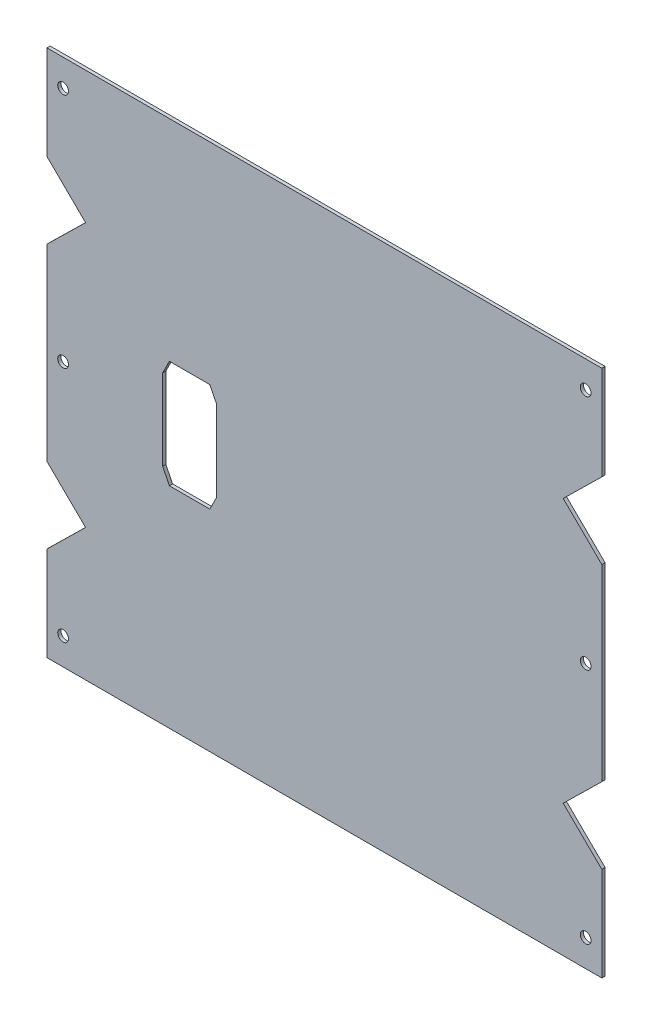
ISO-10303-21;
HEADER;
FILE_DESCRIPTION(('STEP AP214'),'2;1');
FILE_NAME('part.step','',(''),(''),'','','');
FILE_SCHEMA(('AUTOMOTIVE_DESIGN { 1 0 10303 214 1 1 1 1 }'));
ENDSEC;
DATA;
#1=APPLICATION_CONTEXT('core data for automotive mechanical design processes');
#2=APPLICATION_PROTOCOL_DEFINITION('international standard','automotive_design',2000,#1);
#3=PRODUCT_CONTEXT('',#1,'mechanical');
#4=PRODUCT('Part','Part','',(#3));
#5=PRODUCT_RELATED_PRODUCT_CATEGORY('part','',(#4));
#6=PRODUCT_DEFINITION_FORMATION('','',#4);
#7=PRODUCT_DEFINITION_CONTEXT('part definition',#1,'design');
#8=PRODUCT_DEFINITION('design','',#6,#7);
#9=PRODUCT_DEFINITION_SHAPE('','',#8);
#10=(LENGTH_UNIT() NAMED_UNIT(*) SI_UNIT(.MILLI.,.METRE.));
#11=(NAMED_UNIT(*) PLANE_ANGLE_UNIT() SI_UNIT($,.RADIAN.));
#12=(NAMED_UNIT(*) SI_UNIT($,.STERADIAN.) SOLID_ANGLE_UNIT());
#13=UNCERTAINTY_MEASURE_WITH_UNIT(LENGTH_MEASURE(1.E-05),#10,'distance_accuracy_value','');
#14=(GEOMETRIC_REPRESENTATION_CONTEXT(3) GLOBAL_UNCERTAINTY_ASSIGNED_CONTEXT((#13)) GLOBAL_UNIT_ASSIGNED_CONTEXT((#10,
#11,#12)) REPRESENTATION_CONTEXT('',''));
#15=CARTESIAN_POINT('',(0.,0.,0.));
#16=DIRECTION('',(0.,0.,1.));
#17=DIRECTION('',(1.,0.,0.));
#18=AXIS2_PLACEMENT_3D('',#15,#16,#17);
#19=CARTESIAN_POINT('',(0.,0.,-1.2));
#20=DIRECTION('',(0.,0.,1.));
#21=DIRECTION('',(1.,0.,0.));
#22=AXIS2_PLACEMENT_3D('',#19,#20,#21);
#23=PLANE('',#22);
#24=DIRECTION('',(0.71325044915418,0.700909264299852,0.));
#25=VECTOR('',#24,1.);
#26=CARTESIAN_POINT('',(-112.735272182629,25.2473417299541,-1.19999999999987));
#27=LINE('',#26,#25);
#28=CARTESIAN_POINT('',(-102.924778563656,34.8880869591322,-1.19999999999992));
#29=VERTEX_POINT('',#28);
#30=CARTESIAN_POINT('',(-88.5983859319865,48.9665937885951,-1.20000000000002));
#31=VERTEX_POINT('',#30);
#32=EDGE_CURVE('E723',#29,#31,#27,.T.);
#33=ORIENTED_EDGE('',*,*,#32,.T.);
#34=DIRECTION('',(-0.71325044915418,0.700909264299853,0.));
#35=VECTOR('',#34,1.);
#36=CARTESIAN_POINT('',(-112.735272182629,72.6858458472359,-1.1999999999997));
#37=LINE('',#36,#35);
#38=CARTESIAN_POINT('',(-102.924778563656,63.045100618058,-1.19999999999985));
#39=VERTEX_POINT('',#38);
#40=EDGE_CURVE('E753',#31,#39,#37,.T.);
#41=ORIENTED_EDGE('',*,*,#40,.T.);
#42=DIRECTION('',(0.,1.,0.));
#43=VECTOR('',#42,1.);
#44=CARTESIAN_POINT('',(-102.924778563656,50.1160676339586,-1.19999999999993));
#45=LINE('',#44,#43);
#46=CARTESIAN_POINT('',(-102.924778563656,97.9541336551041,-1.19999999999962));
#47=VERTEX_POINT('',#46);
#48=EDGE_CURVE('E759',#47,#39,#45,.F.);
#49=ORIENTED_EDGE('',*,*,#48,.F.);
#50=DIRECTION('',(1.,0.,0.));
#51=VECTOR('',#50,1.);
#52=CARTESIAN_POINT('',(-102.924778563656,97.9541336551041,-1.19999999999962));
#53=LINE('',#52,#51);
#54=CARTESIAN_POINT('',(102.924778563656,97.9541336551041,-1.19999999999956));
#55=VERTEX_POINT('',#54);
#56=EDGE_CURVE('E778',#55,#47,#53,.F.);
#57=ORIENTED_EDGE('',*,*,#56,.F.);
#58=DIRECTION('',(0.,-1.,0.));
#59=VECTOR('',#58,1.);
#60=CARTESIAN_POINT('',(102.924778563656,97.9541336551041,-1.19999999999956));
#61=LINE('',#60,#59);
#62=CARTESIAN_POINT('',(102.924778563656,63.045100618058,-1.19999999999978));
#63=VERTEX_POINT('',#62);
#64=EDGE_CURVE('E772',#63,#55,#61,.F.);
#65=ORIENTED_EDGE('',*,*,#64,.F.);
#66=DIRECTION('',(-0.71325044915418,-0.700909264299853,0.));
#67=VECTOR('',#66,1.);
#68=CARTESIAN_POINT('',(112.735272182628,72.6858458472358,-1.19999999999965));
#69=LINE('',#68,#67);
#70=CARTESIAN_POINT('',(88.5983859319865,48.966593788595,-1.19999999999998));
#71=VERTEX_POINT('',#70);
#72=EDGE_CURVE('E751',#63,#71,#69,.T.);
#73=ORIENTED_EDGE('',*,*,#72,.T.);
#74=DIRECTION('',(0.713250449154181,-0.700909264299852,0.));
#75=VECTOR('',#74,1.);
#76=CARTESIAN_POINT('',(112.735272182629,25.2473417299542,-1.19999999999987));
#77=LINE('',#76,#75);
#78=CARTESIAN_POINT('',(102.924778563656,34.8880869591322,-1.19999999999994));
#79=VERTEX_POINT('',#78);
#80=EDGE_CURVE('E864',#71,#79,#77,.T.);
#81=ORIENTED_EDGE('',*,*,#80,.T.);
#82=DIRECTION('',(0.,-1.,0.));
#83=VECTOR('',#82,1.);
#84=CARTESIAN_POINT('',(102.924778563656,47.8171199432316,-1.19999999999994));
#85=LINE('',#84,#83);
#86=CARTESIAN_POINT('',(102.924778563656,-34.8880869591322,-1.19999999999991));
#87=VERTEX_POINT('',#86);
#88=EDGE_CURVE('E831',#87,#79,#85,.F.);
#89=ORIENTED_EDGE('',*,*,#88,.F.);
#90=DIRECTION('',(-0.71325044915418,-0.700909264299852,0.));
#91=VECTOR('',#90,1.);
#92=CARTESIAN_POINT('',(112.735272182629,-25.2473417299541,-1.19999999999985));
#93=LINE('',#92,#91);
#94=CARTESIAN_POINT('',(88.5983859319865,-48.9665937885951,-1.2));
#95=VERTEX_POINT('',#94);
#96=EDGE_CURVE('E862',#87,#95,#93,.T.);
#97=ORIENTED_EDGE('',*,*,#96,.T.);
#98=DIRECTION('',(0.71325044915418,-0.700909264299853,0.));
#99=VECTOR('',#98,1.);
#100=CARTESIAN_POINT('',(112.735272182629,-72.6858458472359,-1.19999999999974));
#101=LINE('',#100,#99);
#102=CARTESIAN_POINT('',(102.924778563656,-63.045100618058,-1.19999999999987));
#103=VERTEX_POINT('',#102);
#104=EDGE_CURVE('E793',#95,#103,#101,.T.);
#105=ORIENTED_EDGE('',*,*,#104,.T.);
#106=DIRECTION('',(0.,-1.,0.));
#107=VECTOR('',#106,1.);
#108=CARTESIAN_POINT('',(102.924778563656,-50.1160676339586,-1.19999999999993));
#109=LINE('',#108,#107);
#110=CARTESIAN_POINT('',(102.924778563656,-97.9541336551041,-1.19999999999965));
#111=VERTEX_POINT('',#110);
#112=EDGE_CURVE('E804',#111,#103,#109,.F.);
#113=ORIENTED_EDGE('',*,*,#112,.F.);
#114=DIRECTION('',(-1.,0.,0.));
#115=VECTOR('',#114,1.);
#116=CARTESIAN_POINT('',(-89.1247785636565,-97.9541336551041,-1.19999999999969));
#117=LINE('',#116,#115);
#118=CARTESIAN_POINT('',(-102.924778563657,-97.954133655104,-1.19999999999958));
#119=VERTEX_POINT('',#118);
#120=EDGE_CURVE('E819',#119,#111,#117,.F.);
#121=ORIENTED_EDGE('',*,*,#120,.F.);
#122=DIRECTION('',(0.,1.,0.));
#123=VECTOR('',#122,1.);
#124=CARTESIAN_POINT('',(-102.924778563657,-97.954133655104,-1.19999999999958));
#125=LINE('',#124,#123);
#126=CARTESIAN_POINT('',(-102.924778563656,-63.0451006180579,-1.19999999999992));
#127=VERTEX_POINT('',#126);
#128=EDGE_CURVE('E814',#127,#119,#125,.F.);
#129=ORIENTED_EDGE('',*,*,#128,.F.);
#130=DIRECTION('',(0.713250449154182,0.700909264299851,0.));
#131=VECTOR('',#130,1.);
#132=CARTESIAN_POINT('',(-112.735272182629,-72.6858458472357,-1.19999999999976));
#133=LINE('',#132,#131);
#134=CARTESIAN_POINT('',(-88.5983859319865,-48.9665937885951,-1.20000000000018));
#135=VERTEX_POINT('',#134);
#136=EDGE_CURVE('E796',#127,#135,#133,.T.);
#137=ORIENTED_EDGE('',*,*,#136,.T.);
#138=DIRECTION('',(-0.71325044915418,0.700909264299852,0.));
#139=VECTOR('',#138,1.);
#140=CARTESIAN_POINT('',(-112.735272182629,-25.2473417299542,-1.19999999999987));
#141=LINE('',#140,#139);
#142=CARTESIAN_POINT('',(-102.924778563656,-34.8880869591322,-1.19999999999992));
#143=VERTEX_POINT('',#142);
#144=EDGE_CURVE('E728',#135,#143,#141,.T.);
#145=ORIENTED_EDGE('',*,*,#144,.T.);
#146=DIRECTION('',(0.,1.,0.));
#147=VECTOR('',#146,1.);
#148=CARTESIAN_POINT('',(-102.924778563656,-47.8171199432316,-1.19999999999992));
#149=LINE('',#148,#147);
#150=EDGE_CURVE('E790',#29,#143,#149,.F.);
#151=ORIENTED_EDGE('',*,*,#150,.F.);
#152=EDGE_LOOP('',(#33,#41,#49,#57,#65,#73,#81,#89,#97,#105,#113,#121,#129,#137,#145,#151));
#153=FACE_BOUND('',#152,.T.);
#154=DIRECTION('',(-0.447213595499958,-0.894427190999916,0.));
#155=VECTOR('',#154,1.);
#156=CARTESIAN_POINT('',(-60.,14.9832151274244,-1.2));
#157=LINE('',#156,#155);
#158=CARTESIAN_POINT('',(-57.5,19.9832151274244,-1.2));
#159=VERTEX_POINT('',#158);
#160=CARTESIAN_POINT('',(-60.,14.9832151274244,-1.2));
#161=VERTEX_POINT('',#160);
#162=EDGE_CURVE('E892',#159,#161,#157,.T.);
#163=ORIENTED_EDGE('',*,*,#162,.T.);
#164=DIRECTION('',(0.,-1.,0.));
#165=VECTOR('',#164,1.);
#166=CARTESIAN_POINT('',(-60.,-15.0167848725756,-1.2));
#167=LINE('',#166,#165);
#168=CARTESIAN_POINT('',(-60.,-15.0167848725756,-1.2));
#169=VERTEX_POINT('',#168);
#170=EDGE_CURVE('E872',#161,#169,#167,.T.);
#171=ORIENTED_EDGE('',*,*,#170,.T.);
#172=DIRECTION('',(0.447213595499958,-0.894427190999916,0.));
#173=VECTOR('',#172,1.);
#174=CARTESIAN_POINT('',(-57.5,-20.0167848725756,-1.2));
#175=LINE('',#174,#173);
#176=CARTESIAN_POINT('',(-57.5,-20.0167848725756,-1.2));
#177=VERTEX_POINT('',#176);
#178=EDGE_CURVE('E875',#169,#177,#175,.T.);
#179=ORIENTED_EDGE('',*,*,#178,.T.);
#180=DIRECTION('',(1.,0.,0.));
#181=VECTOR('',#180,1.);
#182=CARTESIAN_POINT('',(-42.5,-20.0167848725756,-1.2));
#183=LINE('',#182,#181);
#184=CARTESIAN_POINT('',(-42.5,-20.0167848725756,-1.2));
#185=VERTEX_POINT('',#184);
#186=EDGE_CURVE('E558',#177,#185,#183,.T.);
#187=ORIENTED_EDGE('',*,*,#186,.T.);
#188=DIRECTION('',(0.447213595499958,0.894427190999916,0.));
#189=VECTOR('',#188,1.);
#190=CARTESIAN_POINT('',(-40.,-15.0167848725756,-1.2));
#191=LINE('',#190,#189);
#192=CARTESIAN_POINT('',(-40.,-15.0167848725756,-1.2));
#193=VERTEX_POINT('',#192);
#194=EDGE_CURVE('E880',#185,#193,#191,.T.);
#195=ORIENTED_EDGE('',*,*,#194,.T.);
#196=DIRECTION('',(0.,1.,0.));
#197=VECTOR('',#196,1.);
#198=CARTESIAN_POINT('',(-40.,14.9832151274244,-1.2));
#199=LINE('',#198,#197);
#200=CARTESIAN_POINT('',(-40.,14.9832151274244,-1.2));
#201=VERTEX_POINT('',#200);
#202=EDGE_CURVE('E883',#193,#201,#199,.T.);
#203=ORIENTED_EDGE('',*,*,#202,.T.);
#204=DIRECTION('',(-0.447213595499958,0.894427190999916,0.));
#205=VECTOR('',#204,1.);
#206=CARTESIAN_POINT('',(-42.5,19.9832151274244,-1.2));
#207=LINE('',#206,#205);
#208=CARTESIAN_POINT('',(-42.5,19.9832151274244,-1.2));
#209=VERTEX_POINT('',#208);
#210=EDGE_CURVE('E886',#201,#209,#207,.T.);
#211=ORIENTED_EDGE('',*,*,#210,.T.);
#212=DIRECTION('',(-1.,0.,0.));
#213=VECTOR('',#212,1.);
#214=CARTESIAN_POINT('',(-57.5,19.9832151274244,-1.2));
#215=LINE('',#214,#213);
#216=EDGE_CURVE('E889',#209,#159,#215,.T.);
#217=ORIENTED_EDGE('',*,*,#216,.T.);
#218=EDGE_LOOP('',(#163,#171,#179,#187,#195,#203,#211,#217));
#219=FACE_BOUND('',#218,.T.);
#220=CARTESIAN_POINT('',(96.9247785636565,0.128533104245435,-1.19999999999997));
#221=DIRECTION('',(0.,0.,-1.));
#222=DIRECTION('',(-1.,0.,0.));
#223=AXIS2_PLACEMENT_3D('',#220,#221,#222);
#224=CIRCLE('',#223,2.);
#225=CARTESIAN_POINT('',(94.9247785636565,0.128533104245435,-1.19999999999998));
#226=VERTEX_POINT('',#225);
#227=EDGE_CURVE('E867',#226,#226,#224,.T.);
#228=ORIENTED_EDGE('',*,*,#227,.F.);
#229=EDGE_LOOP('',(#228));
#230=FACE_BOUND('',#229,.T.);
#231=CARTESIAN_POINT('',(-96.9247785636564,0.128533104244721,-1.19999999999997));
#232=DIRECTION('',(0.,0.,-1.));
#233=DIRECTION('',(-1.,0.,0.));
#234=AXIS2_PLACEMENT_3D('',#231,#232,#233);
#235=CIRCLE('',#234,2.);
#236=CARTESIAN_POINT('',(-98.9247785636564,0.128533104244721,-1.19999999999995));
#237=VERTEX_POINT('',#236);
#238=EDGE_CURVE('E842',#237,#237,#235,.T.);
#239=ORIENTED_EDGE('',*,*,#238,.F.);
#240=EDGE_LOOP('',(#239));
#241=FACE_BOUND('',#240,.T.);
#242=CARTESIAN_POINT('',(96.9247785636571,-87.9541336551041,-1.19999999999976));
#243=DIRECTION('',(0.,0.,-1.));
#244=DIRECTION('',(-0.999847695156391,-0.0174524064372864,0.));
#245=AXIS2_PLACEMENT_3D('',#242,#243,#244);
#246=CIRCLE('',#245,2.);
#247=CARTESIAN_POINT('',(94.9250831733443,-87.9890384679787,-1.19999999999977));
#248=VERTEX_POINT('',#247);
#249=EDGE_CURVE('E816',#248,#248,#246,.T.);
#250=ORIENTED_EDGE('',*,*,#249,.F.);
#251=EDGE_LOOP('',(#250));
#252=FACE_BOUND('',#251,.T.);
#253=CARTESIAN_POINT('',(-96.9247785636565,-87.954133655104,-1.19999999999969));
#254=DIRECTION('',(0.,0.,-1.));
#255=DIRECTION('',(-0.999847695156391,0.0174524064372899,0.));
#256=AXIS2_PLACEMENT_3D('',#253,#254,#255);
#257=CIRCLE('',#256,2.);
#258=CARTESIAN_POINT('',(-98.9244739539693,-87.9192288422295,-1.19999999999968));
#259=VERTEX_POINT('',#258);
#260=EDGE_CURVE('E743',#259,#259,#257,.T.);
#261=ORIENTED_EDGE('',*,*,#260,.F.);
#262=EDGE_LOOP('',(#261));
#263=FACE_BOUND('',#262,.T.);
#264=CARTESIAN_POINT('',(96.9247785636557,87.9541336551042,-1.19999999999967));
#265=DIRECTION('',(0.,0.,-1.));
#266=DIRECTION('',(0.999847695156391,-0.0174524064372864,0.));
#267=AXIS2_PLACEMENT_3D('',#264,#265,#266);
#268=CIRCLE('',#267,2.);
#269=CARTESIAN_POINT('',(98.9244739539685,87.9192288422296,-1.19999999999966));
#270=VERTEX_POINT('',#269);
#271=EDGE_CURVE('E780',#270,#270,#268,.T.);
#272=ORIENTED_EDGE('',*,*,#271,.F.);
#273=EDGE_LOOP('',(#272));
#274=FACE_BOUND('',#273,.T.);
#275=CARTESIAN_POINT('',(-96.9247785636564,87.9541336551041,-1.19999999999974));
#276=DIRECTION('',(0.,0.,-1.));
#277=DIRECTION('',(0.999847695156391,0.0174524064372864,0.));
#278=AXIS2_PLACEMENT_3D('',#275,#276,#277);
#279=CIRCLE('',#278,2.);
#280=CARTESIAN_POINT('',(-94.9250831733436,87.9890384679787,-1.19999999999976));
#281=VERTEX_POINT('',#280);
#282=EDGE_CURVE('E740',#281,#281,#279,.T.);
#283=ORIENTED_EDGE('',*,*,#282,.F.);
#284=EDGE_LOOP('',(#283));
#285=FACE_BOUND('',#284,.T.);
#286=ADVANCED_FACE('F541',(#153,#219,#230,#241,#252,#263,#274,#285),#23,.F.);
#287=CARTESIAN_POINT('',(0.,0.,0.));
#288=DIRECTION('',(0.,0.,1.));
#289=DIRECTION('',(1.,0.,0.));
#290=AXIS2_PLACEMENT_3D('',#287,#288,#289);
#291=PLANE('',#290);
#292=DIRECTION('',(-0.71325044915418,0.700909264299853,0.));
#293=VECTOR('',#292,1.);
#294=CARTESIAN_POINT('',(-90.1247785636564,50.4665756501771,0.));
#295=LINE('',#294,#293);
#296=CARTESIAN_POINT('',(-88.5983859319865,48.9665937885951,0.));
#297=VERTEX_POINT('',#296);
#298=CARTESIAN_POINT('',(-102.924778563656,63.045100618058,1.59594559789866E-13));
#299=VERTEX_POINT('',#298);
#300=EDGE_CURVE('E744',#297,#299,#295,.T.);
#301=ORIENTED_EDGE('',*,*,#300,.F.);
#302=DIRECTION('',(0.71325044915418,0.700909264299852,0.));
#303=VECTOR('',#302,1.);
#304=CARTESIAN_POINT('',(-158.454011488257,-19.6803382587869,4.57966997657877E-13));
#305=LINE('',#304,#303);
#306=CARTESIAN_POINT('',(-102.924778563656,34.8880869591322,0.));
#307=VERTEX_POINT('',#306);
#308=EDGE_CURVE('E829',#307,#297,#305,.T.);
#309=ORIENTED_EDGE('',*,*,#308,.F.);
#310=DIRECTION('',(0.,-1.,0.));
#311=VECTOR('',#310,1.);
#312=CARTESIAN_POINT('',(-102.924778563656,0.,0.));
#313=LINE('',#312,#311);
#314=CARTESIAN_POINT('',(-102.924778563656,-34.8880869591322,0.));
#315=VERTEX_POINT('',#314);
#316=EDGE_CURVE('E719',#307,#315,#313,.T.);
#317=ORIENTED_EDGE('',*,*,#316,.T.);
#318=DIRECTION('',(-0.71325044915418,0.700909264299852,0.));
#319=VECTOR('',#318,1.);
#320=CARTESIAN_POINT('',(-90.1247785636564,-47.4666119270131,0.));
#321=LINE('',#320,#319);
#322=CARTESIAN_POINT('',(-88.5983859319864,-48.9665937885951,-1.77809156287623E-13));
#323=VERTEX_POINT('',#322);
#324=EDGE_CURVE('E715',#323,#315,#321,.T.);
#325=ORIENTED_EDGE('',*,*,#324,.F.);
#326=DIRECTION('',(0.713250449154182,0.700909264299851,0.));
#327=VECTOR('',#326,1.);
#328=CARTESIAN_POINT('',(-125.520796593012,-85.2501456928183,4.64905891561784E-13));
#329=LINE('',#328,#327);
#330=CARTESIAN_POINT('',(-102.924778563656,-63.0451006180579,0.));
#331=VERTEX_POINT('',#330);
#332=EDGE_CURVE('E703',#331,#323,#329,.T.);
#333=ORIENTED_EDGE('',*,*,#332,.F.);
#334=DIRECTION('',(0.,-1.,0.));
#335=VECTOR('',#334,1.);
#336=CARTESIAN_POINT('',(-102.924778563656,-47.0818788927046,0.));
#337=LINE('',#336,#335);
#338=CARTESIAN_POINT('',(-102.924778563656,-97.954133655104,4.30211422042248E-13));
#339=VERTEX_POINT('',#338);
#340=EDGE_CURVE('E812',#331,#339,#337,.T.);
#341=ORIENTED_EDGE('',*,*,#340,.T.);
#342=DIRECTION('',(1.,0.,0.));
#343=VECTOR('',#342,1.);
#344=CARTESIAN_POINT('',(-137.896220433751,-97.9541336551039,6.80011602582908E-13));
#345=LINE('',#344,#343);
#346=CARTESIAN_POINT('',(102.924778563656,-97.9541336551041,3.53883589099269E-13));
#347=VERTEX_POINT('',#346);
#348=EDGE_CURVE('E810',#339,#347,#345,.T.);
#349=ORIENTED_EDGE('',*,*,#348,.T.);
#350=DIRECTION('',(0.,1.,0.));
#351=VECTOR('',#350,1.);
#352=CARTESIAN_POINT('',(102.924778563656,-47.0818788927048,0.));
#353=LINE('',#352,#351);
#354=CARTESIAN_POINT('',(102.924778563656,-63.045100618058,1.45716771982052E-13));
#355=VERTEX_POINT('',#354);
#356=EDGE_CURVE('E798',#347,#355,#353,.T.);
#357=ORIENTED_EDGE('',*,*,#356,.T.);
#358=DIRECTION('',(0.71325044915418,-0.700909264299853,0.));
#359=VECTOR('',#358,1.);
#360=CARTESIAN_POINT('',(90.1247785636564,-50.4665756501771,0.));
#361=LINE('',#360,#359);
#362=CARTESIAN_POINT('',(88.5983859319864,-48.9665937885951,0.));
#363=VERTEX_POINT('',#362);
#364=EDGE_CURVE('E712',#363,#355,#361,.T.);
#365=ORIENTED_EDGE('',*,*,#364,.F.);
#366=DIRECTION('',(-0.71325044915418,-0.700909264299852,0.));
#367=VECTOR('',#366,1.);
#368=CARTESIAN_POINT('',(158.454011488257,19.6803382587869,4.71844785465692E-13));
#369=LINE('',#368,#367);
#370=CARTESIAN_POINT('',(102.924778563656,-34.8880869591322,0.));
#371=VERTEX_POINT('',#370);
#372=EDGE_CURVE('E847',#371,#363,#369,.T.);
#373=ORIENTED_EDGE('',*,*,#372,.F.);
#374=DIRECTION('',(0.,1.,0.));
#375=VECTOR('',#374,1.);
#376=CARTESIAN_POINT('',(102.924778563656,0.,0.));
#377=LINE('',#376,#375);
#378=CARTESIAN_POINT('',(102.924778563656,34.8880869591322,0.));
#379=VERTEX_POINT('',#378);
#380=EDGE_CURVE('E852',#371,#379,#377,.T.);
#381=ORIENTED_EDGE('',*,*,#380,.T.);
#382=DIRECTION('',(0.713250449154181,-0.700909264299852,0.));
#383=VECTOR('',#382,1.);
#384=CARTESIAN_POINT('',(90.1247785636564,47.4666119270131,0.));
#385=LINE('',#384,#383);
#386=CARTESIAN_POINT('',(88.5983859319865,48.966593788595,0.));
#387=VERTEX_POINT('',#386);
#388=EDGE_CURVE('E860',#387,#379,#385,.T.);
#389=ORIENTED_EDGE('',*,*,#388,.F.);
#390=DIRECTION('',(-0.71325044915418,-0.700909264299853,0.));
#391=VECTOR('',#390,1.);
#392=CARTESIAN_POINT('',(125.520796593012,85.2501456928184,5.55111512312578E-13));
#393=LINE('',#392,#391);
#394=CARTESIAN_POINT('',(102.924778563656,63.045100618058,2.28983498828939E-13));
#395=VERTEX_POINT('',#394);
#396=EDGE_CURVE('E746',#395,#387,#393,.T.);
#397=ORIENTED_EDGE('',*,*,#396,.F.);
#398=DIRECTION('',(0.,1.,0.));
#399=VECTOR('',#398,1.);
#400=CARTESIAN_POINT('',(102.924778563656,47.0818788927047,1.2490009027033E-13));
#401=LINE('',#400,#399);
#402=CARTESIAN_POINT('',(102.924778563656,97.9541336551041,4.5102810375397E-13));
#403=VERTEX_POINT('',#402);
#404=EDGE_CURVE('E767',#395,#403,#401,.T.);
#405=ORIENTED_EDGE('',*,*,#404,.T.);
#406=DIRECTION('',(-1.,0.,0.));
#407=VECTOR('',#406,1.);
#408=CARTESIAN_POINT('',(137.896220433751,97.9541336551041,7.0082828429463E-13));
#409=LINE('',#408,#407);
#410=CARTESIAN_POINT('',(-102.924778563656,97.9541336551041,3.81639164714898E-13));
#411=VERTEX_POINT('',#410);
#412=EDGE_CURVE('E765',#403,#411,#409,.T.);
#413=ORIENTED_EDGE('',*,*,#412,.T.);
#414=DIRECTION('',(0.,-1.,0.));
#415=VECTOR('',#414,1.);
#416=CARTESIAN_POINT('',(-102.924778563656,47.0818788927047,0.));
#417=LINE('',#416,#415);
#418=EDGE_CURVE('E756',#411,#299,#417,.T.);
#419=ORIENTED_EDGE('',*,*,#418,.T.);
#420=EDGE_LOOP('',(#301,#309,#317,#325,#333,#341,#349,#357,#365,#373,#381,#389,#397,#405,#413,#419));
#421=FACE_BOUND('',#420,.T.);
#422=DIRECTION('',(0.,-1.,0.));
#423=VECTOR('',#422,1.);
#424=CARTESIAN_POINT('',(-60.,-15.0167848725756,0.));
#425=LINE('',#424,#423);
#426=CARTESIAN_POINT('',(-60.,14.9832151274244,0.));
#427=VERTEX_POINT('',#426);
#428=CARTESIAN_POINT('',(-60.,-15.0167848725756,0.));
#429=VERTEX_POINT('',#428);
#430=EDGE_CURVE('E565',#427,#429,#425,.T.);
#431=ORIENTED_EDGE('',*,*,#430,.F.);
#432=DIRECTION('',(-0.447213595499958,-0.894427190999916,0.));
#433=VECTOR('',#432,1.);
#434=CARTESIAN_POINT('',(-60.,14.9832151274244,0.));
#435=LINE('',#434,#433);
#436=CARTESIAN_POINT('',(-57.5,19.9832151274244,0.));
#437=VERTEX_POINT('',#436);
#438=EDGE_CURVE('E876',#437,#427,#435,.T.);
#439=ORIENTED_EDGE('',*,*,#438,.F.);
#440=DIRECTION('',(-1.,0.,0.));
#441=VECTOR('',#440,1.);
#442=CARTESIAN_POINT('',(-57.5,19.9832151274244,0.));
#443=LINE('',#442,#441);
#444=CARTESIAN_POINT('',(-42.5,19.9832151274244,0.));
#445=VERTEX_POINT('',#444);
#446=EDGE_CURVE('E911',#445,#437,#443,.T.);
#447=ORIENTED_EDGE('',*,*,#446,.F.);
#448=DIRECTION('',(-0.447213595499958,0.894427190999916,0.));
#449=VECTOR('',#448,1.);
#450=CARTESIAN_POINT('',(-42.5,19.9832151274244,0.));
#451=LINE('',#450,#449);
#452=CARTESIAN_POINT('',(-40.,14.9832151274244,0.));
#453=VERTEX_POINT('',#452);
#454=EDGE_CURVE('E908',#453,#445,#451,.T.);
#455=ORIENTED_EDGE('',*,*,#454,.F.);
#456=DIRECTION('',(0.,1.,0.));
#457=VECTOR('',#456,1.);
#458=CARTESIAN_POINT('',(-40.,14.9832151274244,0.));
#459=LINE('',#458,#457);
#460=CARTESIAN_POINT('',(-40.,-15.0167848725756,0.));
#461=VERTEX_POINT('',#460);
#462=EDGE_CURVE('E905',#461,#453,#459,.T.);
#463=ORIENTED_EDGE('',*,*,#462,.F.);
#464=DIRECTION('',(0.447213595499958,0.894427190999916,0.));
#465=VECTOR('',#464,1.);
#466=CARTESIAN_POINT('',(-40.,-15.0167848725756,0.));
#467=LINE('',#466,#465);
#468=CARTESIAN_POINT('',(-42.5,-20.0167848725756,0.));
#469=VERTEX_POINT('',#468);
#470=EDGE_CURVE('E902',#469,#461,#467,.T.);
#471=ORIENTED_EDGE('',*,*,#470,.F.);
#472=DIRECTION('',(1.,0.,0.));
#473=VECTOR('',#472,1.);
#474=CARTESIAN_POINT('',(-42.5,-20.0167848725756,0.));
#475=LINE('',#474,#473);
#476=CARTESIAN_POINT('',(-57.5,-20.0167848725756,0.));
#477=VERTEX_POINT('',#476);
#478=EDGE_CURVE('E899',#477,#469,#475,.T.);
#479=ORIENTED_EDGE('',*,*,#478,.F.);
#480=DIRECTION('',(0.447213595499958,-0.894427190999916,0.));
#481=VECTOR('',#480,1.);
#482=CARTESIAN_POINT('',(-57.5,-20.0167848725756,0.));
#483=LINE('',#482,#481);
#484=EDGE_CURVE('E896',#429,#477,#483,.T.);
#485=ORIENTED_EDGE('',*,*,#484,.F.);
#486=EDGE_LOOP('',(#431,#439,#447,#455,#463,#471,#479,#485));
#487=FACE_BOUND('',#486,.T.);
#488=CARTESIAN_POINT('',(96.9247785636565,0.128533104245439,2.91433543964104E-13));
#489=DIRECTION('',(0.,0.,-1.));
#490=DIRECTION('',(0.,-1.,0.));
#491=AXIS2_PLACEMENT_3D('',#488,#489,#490);
#492=CIRCLE('',#491,2.);
#493=CARTESIAN_POINT('',(96.9247785636565,-1.87146689575456,2.99467287178032E-13));
#494=VERTEX_POINT('',#493);
#495=EDGE_CURVE('E855',#494,#494,#492,.T.);
#496=ORIENTED_EDGE('',*,*,#495,.T.);
#497=EDGE_LOOP('',(#496));
#498=FACE_BOUND('',#497,.T.);
#499=CARTESIAN_POINT('',(-96.9247785636564,0.128533104244716,2.08166817117217E-13));
#500=DIRECTION('',(0.,0.,1.));
#501=DIRECTION('',(0.,-1.,0.));
#502=AXIS2_PLACEMENT_3D('',#499,#500,#501);
#503=CIRCLE('',#502,2.);
#504=CARTESIAN_POINT('',(-96.9247785636564,-1.87146689575528,2.00133073903288E-13));
#505=VERTEX_POINT('',#504);
#506=EDGE_CURVE('E839',#505,#505,#503,.T.);
#507=ORIENTED_EDGE('',*,*,#506,.F.);
#508=EDGE_LOOP('',(#507));
#509=FACE_BOUND('',#508,.T.);
#510=CARTESIAN_POINT('',(96.9247785636571,-87.9541336551041,6.59194920871187E-13));
#511=DIRECTION('',(0.,0.,-1.));
#512=DIRECTION('',(-0.999847695156391,-0.0174524064372864,0.));
#513=AXIS2_PLACEMENT_3D('',#510,#511,#512);
#514=CIRCLE('',#513,2.);
#515=CARTESIAN_POINT('',(94.9250831733443,-87.9890384679787,6.60467774221685E-13));
#516=VERTEX_POINT('',#515);
#517=EDGE_CURVE('E801',#516,#516,#514,.T.);
#518=ORIENTED_EDGE('',*,*,#517,.T.);
#519=EDGE_LOOP('',(#518));
#520=FACE_BOUND('',#519,.T.);
#521=CARTESIAN_POINT('',(-96.9247785636565,-87.954133655104,2.77555756156289E-13));
#522=DIRECTION('',(0.,0.,1.));
#523=DIRECTION('',(0.999847695156391,-0.0174524064372899,0.));
#524=AXIS2_PLACEMENT_3D('',#521,#522,#523);
#525=CIRCLE('',#524,2.);
#526=CARTESIAN_POINT('',(-94.9250831733437,-87.9890384679786,2.62882272374088E-13));
#527=VERTEX_POINT('',#526);
#528=EDGE_CURVE('E824',#527,#527,#525,.T.);
#529=ORIENTED_EDGE('',*,*,#528,.F.);
#530=EDGE_LOOP('',(#529));
#531=FACE_BOUND('',#530,.T.);
#532=CARTESIAN_POINT('',(-96.9247785636564,87.9541336551041,6.17561557447743E-13));
#533=DIRECTION('',(0.,0.,1.));
#534=DIRECTION('',(-0.999847695156391,-0.0174524064372864,0.));
#535=AXIS2_PLACEMENT_3D('',#532,#533,#534);
#536=CIRCLE('',#535,2.);
#537=CARTESIAN_POINT('',(-98.9244739539692,87.9192288422295,6.16288704097245E-13));
#538=VERTEX_POINT('',#537);
#539=EDGE_CURVE('E783',#538,#538,#536,.T.);
#540=ORIENTED_EDGE('',*,*,#539,.F.);
#541=EDGE_LOOP('',(#540));
#542=FACE_BOUND('',#541,.T.);
#543=CARTESIAN_POINT('',(96.9247785636557,87.9541336551042,4.09394740330526E-13));
#544=DIRECTION('',(0.,0.,-1.));
#545=DIRECTION('',(0.999847695156391,-0.0174524064372864,0.));
#546=AXIS2_PLACEMENT_3D('',#543,#544,#545);
#547=CIRCLE('',#546,2.);
#548=CARTESIAN_POINT('',(98.9244739539685,87.9192288422296,4.24189329495395E-13));
#549=VERTEX_POINT('',#548);
#550=EDGE_CURVE('E769',#549,#549,#547,.T.);
#551=ORIENTED_EDGE('',*,*,#550,.T.);
#552=EDGE_LOOP('',(#551));
#553=FACE_BOUND('',#552,.T.);
#554=ADVANCED_FACE('F543',(#421,#487,#498,#509,#520,#531,#542,#553),#291,.T.);
#555=CARTESIAN_POINT('',(-60.,-15.0167848725756,-1.2));
#556=DIRECTION('',(-1.,0.,0.));
#557=DIRECTION('',(0.,0.,1.));
#558=AXIS2_PLACEMENT_3D('',#555,#556,#557);
#559=PLANE('',#558);
#560=ORIENTED_EDGE('',*,*,#430,.T.);
#561=DIRECTION('',(0.,0.,1.));
#562=VECTOR('',#561,1.);
#563=CARTESIAN_POINT('',(-60.,-15.0167848725756,-1.2));
#564=LINE('',#563,#562);
#565=EDGE_CURVE('E545',#169,#429,#564,.T.);
#566=ORIENTED_EDGE('',*,*,#565,.F.);
#567=ORIENTED_EDGE('',*,*,#170,.F.);
#568=DIRECTION('',(0.,0.,1.));
#569=VECTOR('',#568,1.);
#570=CARTESIAN_POINT('',(-60.,14.9832151274244,-1.2));
#571=LINE('',#570,#569);
#572=EDGE_CURVE('E13',#161,#427,#571,.T.);
#573=ORIENTED_EDGE('',*,*,#572,.T.);
#574=EDGE_LOOP('',(#560,#566,#567,#573));
#575=FACE_BOUND('',#574,.T.);
#576=ADVANCED_FACE('F943',(#575),#559,.F.);
#577=CARTESIAN_POINT('',(-60.,14.9832151274244,-1.2));
#578=DIRECTION('',(-0.894427190999916,0.447213595499958,0.));
#579=DIRECTION('',(-0.447213595499958,-0.894427190999916,0.));
#580=AXIS2_PLACEMENT_3D('',#577,#578,#579);
#581=PLANE('',#580);
#582=ORIENTED_EDGE('',*,*,#438,.T.);
#583=ORIENTED_EDGE('',*,*,#572,.F.);
#584=ORIENTED_EDGE('',*,*,#162,.F.);
#585=DIRECTION('',(0.,0.,1.));
#586=VECTOR('',#585,1.);
#587=CARTESIAN_POINT('',(-57.5,19.9832151274244,-1.2));
#588=LINE('',#587,#586);
#589=EDGE_CURVE('E550',#159,#437,#588,.T.);
#590=ORIENTED_EDGE('',*,*,#589,.T.);
#591=EDGE_LOOP('',(#582,#583,#584,#590));
#592=FACE_BOUND('',#591,.T.);
#593=ADVANCED_FACE('F945',(#592),#581,.F.);
#594=CARTESIAN_POINT('',(-57.5,19.9832151274244,-1.2));
#595=DIRECTION('',(0.,1.,0.));
#596=DIRECTION('',(0.,0.,1.));
#597=AXIS2_PLACEMENT_3D('',#594,#595,#596);
#598=PLANE('',#597);
#599=ORIENTED_EDGE('',*,*,#446,.T.);
#600=ORIENTED_EDGE('',*,*,#589,.F.);
#601=ORIENTED_EDGE('',*,*,#216,.F.);
#602=DIRECTION('',(0.,0.,1.));
#603=VECTOR('',#602,1.);
#604=CARTESIAN_POINT('',(-42.5,19.9832151274244,-1.2));
#605=LINE('',#604,#603);
#606=EDGE_CURVE('E917',#209,#445,#605,.T.);
#607=ORIENTED_EDGE('',*,*,#606,.T.);
#608=EDGE_LOOP('',(#599,#600,#601,#607));
#609=FACE_BOUND('',#608,.T.);
#610=ADVANCED_FACE('F949',(#609),#598,.F.);
#611=CARTESIAN_POINT('',(-42.5,19.9832151274244,-1.2));
#612=DIRECTION('',(0.894427190999916,0.447213595499958,0.));
#613=DIRECTION('',(-0.447213595499958,0.894427190999916,0.));
#614=AXIS2_PLACEMENT_3D('',#611,#612,#613);
#615=PLANE('',#614);
#616=ORIENTED_EDGE('',*,*,#454,.T.);
#617=ORIENTED_EDGE('',*,*,#606,.F.);
#618=ORIENTED_EDGE('',*,*,#210,.F.);
#619=DIRECTION('',(0.,0.,1.));
#620=VECTOR('',#619,1.);
#621=CARTESIAN_POINT('',(-40.,14.9832151274244,-1.2));
#622=LINE('',#621,#620);
#623=EDGE_CURVE('E919',#201,#453,#622,.T.);
#624=ORIENTED_EDGE('',*,*,#623,.T.);
#625=EDGE_LOOP('',(#616,#617,#618,#624));
#626=FACE_BOUND('',#625,.T.);
#627=ADVANCED_FACE('F953',(#626),#615,.F.);
#628=CARTESIAN_POINT('',(-40.,14.9832151274244,-1.2));
#629=DIRECTION('',(1.,0.,0.));
#630=DIRECTION('',(0.,0.,-1.));
#631=AXIS2_PLACEMENT_3D('',#628,#629,#630);
#632=PLANE('',#631);
#633=ORIENTED_EDGE('',*,*,#462,.T.);
#634=ORIENTED_EDGE('',*,*,#623,.F.);
#635=ORIENTED_EDGE('',*,*,#202,.F.);
#636=DIRECTION('',(0.,0.,1.));
#637=VECTOR('',#636,1.);
#638=CARTESIAN_POINT('',(-40.,-15.0167848725756,-1.2));
#639=LINE('',#638,#637);
#640=EDGE_CURVE('E921',#193,#461,#639,.T.);
#641=ORIENTED_EDGE('',*,*,#640,.T.);
#642=EDGE_LOOP('',(#633,#634,#635,#641));
#643=FACE_BOUND('',#642,.T.);
#644=ADVANCED_FACE('F955',(#643),#632,.F.);
#645=CARTESIAN_POINT('',(-40.,-15.0167848725756,-1.2));
#646=DIRECTION('',(0.894427190999916,-0.447213595499958,0.));
#647=DIRECTION('',(0.447213595499958,0.894427190999916,0.));
#648=AXIS2_PLACEMENT_3D('',#645,#646,#647);
#649=PLANE('',#648);
#650=ORIENTED_EDGE('',*,*,#470,.T.);
#651=ORIENTED_EDGE('',*,*,#640,.F.);
#652=ORIENTED_EDGE('',*,*,#194,.F.);
#653=DIRECTION('',(0.,0.,1.));
#654=VECTOR('',#653,1.);
#655=CARTESIAN_POINT('',(-42.5,-20.0167848725756,-1.2));
#656=LINE('',#655,#654);
#657=EDGE_CURVE('E923',#185,#469,#656,.T.);
#658=ORIENTED_EDGE('',*,*,#657,.T.);
#659=EDGE_LOOP('',(#650,#651,#652,#658));
#660=FACE_BOUND('',#659,.T.);
#661=ADVANCED_FACE('F938',(#660),#649,.F.);
#662=CARTESIAN_POINT('',(-42.5,-20.0167848725756,-1.2));
#663=DIRECTION('',(0.,-1.,0.));
#664=DIRECTION('',(0.,0.,-1.));
#665=AXIS2_PLACEMENT_3D('',#662,#663,#664);
#666=PLANE('',#665);
#667=ORIENTED_EDGE('',*,*,#478,.T.);
#668=ORIENTED_EDGE('',*,*,#657,.F.);
#669=ORIENTED_EDGE('',*,*,#186,.F.);
#670=DIRECTION('',(0.,0.,1.));
#671=VECTOR('',#670,1.);
#672=CARTESIAN_POINT('',(-57.5,-20.0167848725756,-1.2));
#673=LINE('',#672,#671);
#674=EDGE_CURVE('E924',#177,#477,#673,.T.);
#675=ORIENTED_EDGE('',*,*,#674,.T.);
#676=EDGE_LOOP('',(#667,#668,#669,#675));
#677=FACE_BOUND('',#676,.T.);
#678=ADVANCED_FACE('F935',(#677),#666,.F.);
#679=CARTESIAN_POINT('',(-57.5,-20.0167848725756,-1.2));
#680=DIRECTION('',(-0.894427190999916,-0.447213595499958,0.));
#681=DIRECTION('',(0.447213595499958,-0.894427190999916,0.));
#682=AXIS2_PLACEMENT_3D('',#679,#680,#681);
#683=PLANE('',#682);
#684=ORIENTED_EDGE('',*,*,#484,.T.);
#685=ORIENTED_EDGE('',*,*,#674,.F.);
#686=ORIENTED_EDGE('',*,*,#178,.F.);
#687=ORIENTED_EDGE('',*,*,#565,.T.);
#688=EDGE_LOOP('',(#684,#685,#686,#687));
#689=FACE_BOUND('',#688,.T.);
#690=ADVANCED_FACE('F928',(#689),#683,.F.);
#691=CARTESIAN_POINT('',(102.924778563656,47.8171199432316,0.));
#692=DIRECTION('',(-1.,0.,0.));
#693=DIRECTION('',(0.,0.,1.));
#694=AXIS2_PLACEMENT_3D('',#691,#692,#693);
#695=PLANE('',#694);
#696=DIRECTION('',(0.,0.,-1.));
#697=VECTOR('',#696,1.);
#698=CARTESIAN_POINT('',(102.924778563656,34.8880869591322,0.));
#699=LINE('',#698,#697);
#700=EDGE_CURVE('E858',#379,#79,#699,.T.);
#701=ORIENTED_EDGE('',*,*,#700,.F.);
#702=ORIENTED_EDGE('',*,*,#380,.F.);
#703=DIRECTION('',(0.,0.,1.));
#704=VECTOR('',#703,1.);
#705=CARTESIAN_POINT('',(102.924778563656,-34.8880869591322,0.));
#706=LINE('',#705,#704);
#707=EDGE_CURVE('E849',#87,#371,#706,.T.);
#708=ORIENTED_EDGE('',*,*,#707,.F.);
#709=ORIENTED_EDGE('',*,*,#88,.T.);
#710=EDGE_LOOP('',(#701,#702,#708,#709));
#711=FACE_BOUND('',#710,.T.);
#712=ADVANCED_FACE('F974',(#711),#695,.F.);
#713=CARTESIAN_POINT('',(96.9247785636565,0.128533104245439,2.91433543964104E-13));
#714=DIRECTION('',(0.,0.,-1.));
#715=DIRECTION('',(0.,-1.,0.));
#716=AXIS2_PLACEMENT_3D('',#713,#714,#715);
#717=CYLINDRICAL_SURFACE('',#716,2.);
#718=ORIENTED_EDGE('',*,*,#227,.T.);
#719=EDGE_LOOP('',(#718));
#720=FACE_BOUND('',#719,.T.);
#721=ORIENTED_EDGE('',*,*,#495,.F.);
#722=EDGE_LOOP('',(#721));
#723=FACE_BOUND('',#722,.T.);
#724=ADVANCED_FACE('F992',(#720,#723),#717,.F.);
#725=CARTESIAN_POINT('',(90.1247785636564,47.4666119270131,0.));
#726=DIRECTION('',(0.700909264299852,0.713250449154181,0.));
#727=DIRECTION('',(-0.713250449154181,0.700909264299852,0.));
#728=AXIS2_PLACEMENT_3D('',#725,#726,#727);
#729=PLANE('',#728);
#730=ORIENTED_EDGE('',*,*,#80,.F.);
#731=DIRECTION('',(0.,0.,-1.));
#732=VECTOR('',#731,1.);
#733=CARTESIAN_POINT('',(88.5983859319865,48.966593788595,0.));
#734=LINE('',#733,#732);
#735=EDGE_CURVE('E737',#387,#71,#734,.T.);
#736=ORIENTED_EDGE('',*,*,#735,.F.);
#737=ORIENTED_EDGE('',*,*,#388,.T.);
#738=ORIENTED_EDGE('',*,*,#700,.T.);
#739=EDGE_LOOP('',(#730,#736,#737,#738));
#740=FACE_BOUND('',#739,.T.);
#741=ADVANCED_FACE('F1001',(#740),#729,.T.);
#742=CARTESIAN_POINT('',(158.454011488257,19.6803382587869,4.71844785465692E-13));
#743=DIRECTION('',(0.700909264299852,-0.71325044915418,0.));
#744=DIRECTION('',(0.71325044915418,0.700909264299852,0.));
#745=AXIS2_PLACEMENT_3D('',#742,#743,#744);
#746=PLANE('',#745);
#747=ORIENTED_EDGE('',*,*,#96,.F.);
#748=ORIENTED_EDGE('',*,*,#707,.T.);
#749=ORIENTED_EDGE('',*,*,#372,.T.);
#750=DIRECTION('',(0.,0.,-1.));
#751=VECTOR('',#750,1.);
#752=CARTESIAN_POINT('',(88.5983859319864,-48.9665937885951,0.));
#753=LINE('',#752,#751);
#754=EDGE_CURVE('E732',#363,#95,#753,.T.);
#755=ORIENTED_EDGE('',*,*,#754,.T.);
#756=EDGE_LOOP('',(#747,#748,#749,#755));
#757=FACE_BOUND('',#756,.T.);
#758=ADVANCED_FACE('F1010',(#757),#746,.T.);
#759=CARTESIAN_POINT('',(-102.924778563656,-47.8171199432316,0.));
#760=DIRECTION('',(1.,0.,0.));
#761=DIRECTION('',(0.,0.,-1.));
#762=AXIS2_PLACEMENT_3D('',#759,#760,#761);
#763=PLANE('',#762);
#764=DIRECTION('',(0.,0.,-1.));
#765=VECTOR('',#764,1.);
#766=CARTESIAN_POINT('',(-102.924778563656,-34.8880869591322,0.));
#767=LINE('',#766,#765);
#768=EDGE_CURVE('E722',#315,#143,#767,.T.);
#769=ORIENTED_EDGE('',*,*,#768,.F.);
#770=ORIENTED_EDGE('',*,*,#316,.F.);
#771=DIRECTION('',(0.,0.,1.));
#772=VECTOR('',#771,1.);
#773=CARTESIAN_POINT('',(-102.924778563656,34.8880869591322,0.));
#774=LINE('',#773,#772);
#775=EDGE_CURVE('E832',#29,#307,#774,.T.);
#776=ORIENTED_EDGE('',*,*,#775,.F.);
#777=ORIENTED_EDGE('',*,*,#150,.T.);
#778=EDGE_LOOP('',(#769,#770,#776,#777));
#779=FACE_BOUND('',#778,.T.);
#780=ADVANCED_FACE('F1019',(#779),#763,.F.);
#781=CARTESIAN_POINT('',(-96.9247785636571,0.128533104245439,-180.));
#782=DIRECTION('',(0.,0.,1.));
#783=DIRECTION('',(0.,-1.,0.));
#784=AXIS2_PLACEMENT_3D('',#781,#782,#783);
#785=CYLINDRICAL_SURFACE('',#784,2.);
#786=ORIENTED_EDGE('',*,*,#238,.T.);
#787=EDGE_LOOP('',(#786));
#788=FACE_BOUND('',#787,.T.);
#789=ORIENTED_EDGE('',*,*,#506,.T.);
#790=EDGE_LOOP('',(#789));
#791=FACE_BOUND('',#790,.T.);
#792=ADVANCED_FACE('F1028',(#788,#791),#785,.F.);
#793=CARTESIAN_POINT('',(-90.1247785636564,-47.4666119270131,0.));
#794=DIRECTION('',(-0.700909264299852,-0.71325044915418,0.));
#795=DIRECTION('',(-0.71325044915418,0.700909264299852,0.));
#796=AXIS2_PLACEMENT_3D('',#793,#794,#795);
#797=PLANE('',#796);
#798=ORIENTED_EDGE('',*,*,#144,.F.);
#799=DIRECTION('',(0.,0.,-1.));
#800=VECTOR('',#799,1.);
#801=CARTESIAN_POINT('',(-88.5983859319864,-48.9665937885951,-1.77809156287623E-13));
#802=LINE('',#801,#800);
#803=EDGE_CURVE('E708',#323,#135,#802,.T.);
#804=ORIENTED_EDGE('',*,*,#803,.F.);
#805=ORIENTED_EDGE('',*,*,#324,.T.);
#806=ORIENTED_EDGE('',*,*,#768,.T.);
#807=EDGE_LOOP('',(#798,#804,#805,#806));
#808=FACE_BOUND('',#807,.T.);
#809=ADVANCED_FACE('F726',(#808),#797,.T.);
#810=CARTESIAN_POINT('',(-158.454011488257,-19.6803382587869,4.57966997657877E-13));
#811=DIRECTION('',(-0.700909264299852,0.71325044915418,0.));
#812=DIRECTION('',(0.71325044915418,0.700909264299852,0.));
#813=AXIS2_PLACEMENT_3D('',#810,#811,#812);
#814=PLANE('',#813);
#815=ORIENTED_EDGE('',*,*,#32,.F.);
#816=ORIENTED_EDGE('',*,*,#775,.T.);
#817=ORIENTED_EDGE('',*,*,#308,.T.);
#818=DIRECTION('',(0.,0.,-1.));
#819=VECTOR('',#818,1.);
#820=CARTESIAN_POINT('',(-88.5983859319865,48.9665937885951,0.));
#821=LINE('',#820,#819);
#822=EDGE_CURVE('E729',#297,#31,#821,.T.);
#823=ORIENTED_EDGE('',*,*,#822,.T.);
#824=EDGE_LOOP('',(#815,#816,#817,#823));
#825=FACE_BOUND('',#824,.T.);
#826=ADVANCED_FACE('F1045',(#825),#814,.T.);
#827=CARTESIAN_POINT('',(-96.9247785636579,-87.9541336551058,-180.));
#828=DIRECTION('',(0.,0.,1.));
#829=DIRECTION('',(0.999847695156391,-0.0174524064372899,0.));
#830=AXIS2_PLACEMENT_3D('',#827,#828,#829);
#831=CYLINDRICAL_SURFACE('',#830,2.);
#832=ORIENTED_EDGE('',*,*,#260,.T.);
#833=EDGE_LOOP('',(#832));
#834=FACE_BOUND('',#833,.T.);
#835=ORIENTED_EDGE('',*,*,#528,.T.);
#836=EDGE_LOOP('',(#835));
#837=FACE_BOUND('',#836,.T.);
#838=ADVANCED_FACE('F1053',(#834,#837),#831,.F.);
#839=CARTESIAN_POINT('',(-89.1247785636565,-97.954133655104,3.19189119579733E-13));
#840=DIRECTION('',(0.,1.,0.));
#841=DIRECTION('',(1.,0.,0.));
#842=AXIS2_PLACEMENT_3D('',#839,#840,#841);
#843=PLANE('',#842);
#844=ORIENTED_EDGE('',*,*,#120,.T.);
#845=DIRECTION('',(0.,0.,-1.));
#846=VECTOR('',#845,1.);
#847=CARTESIAN_POINT('',(102.924778563656,-97.9541336551041,3.53883589099269E-13));
#848=LINE('',#847,#846);
#849=EDGE_CURVE('E807',#347,#111,#848,.T.);
#850=ORIENTED_EDGE('',*,*,#849,.F.);
#851=ORIENTED_EDGE('',*,*,#348,.F.);
#852=DIRECTION('',(0.,0.,-1.));
#853=VECTOR('',#852,1.);
#854=CARTESIAN_POINT('',(-102.924778563657,-97.954133655104,4.30211422042248E-13));
#855=LINE('',#854,#853);
#856=EDGE_CURVE('E821',#339,#119,#855,.T.);
#857=ORIENTED_EDGE('',*,*,#856,.T.);
#858=EDGE_LOOP('',(#844,#850,#851,#857));
#859=FACE_BOUND('',#858,.T.);
#860=ADVANCED_FACE('F1062',(#859),#843,.F.);
#861=CARTESIAN_POINT('',(96.9247785636571,-87.9541336551041,6.59194920871187E-13));
#862=DIRECTION('',(0.,0.,-1.));
#863=DIRECTION('',(-0.999847695156391,-0.0174524064372864,0.));
#864=AXIS2_PLACEMENT_3D('',#861,#862,#863);
#865=CYLINDRICAL_SURFACE('',#864,2.);
#866=ORIENTED_EDGE('',*,*,#249,.T.);
#867=EDGE_LOOP('',(#866));
#868=FACE_BOUND('',#867,.T.);
#869=ORIENTED_EDGE('',*,*,#517,.F.);
#870=EDGE_LOOP('',(#869));
#871=FACE_BOUND('',#870,.T.);
#872=ADVANCED_FACE('F1072',(#868,#871),#865,.F.);
#873=CARTESIAN_POINT('',(-102.924778563657,-97.954133655104,4.30211422042248E-13));
#874=DIRECTION('',(1.,0.,0.));
#875=DIRECTION('',(0.,-1.,0.));
#876=AXIS2_PLACEMENT_3D('',#873,#874,#875);
#877=PLANE('',#876);
#878=DIRECTION('',(0.,0.,1.));
#879=VECTOR('',#878,1.);
#880=CARTESIAN_POINT('',(-102.924778563656,-63.0451006180579,0.));
#881=LINE('',#880,#879);
#882=EDGE_CURVE('E709',#127,#331,#881,.T.);
#883=ORIENTED_EDGE('',*,*,#882,.F.);
#884=ORIENTED_EDGE('',*,*,#128,.T.);
#885=ORIENTED_EDGE('',*,*,#856,.F.);
#886=ORIENTED_EDGE('',*,*,#340,.F.);
#887=EDGE_LOOP('',(#883,#884,#885,#886));
#888=FACE_BOUND('',#887,.T.);
#889=ADVANCED_FACE('F1082',(#888),#877,.F.);
#890=CARTESIAN_POINT('',(102.924778563656,-50.1160676339586,0.));
#891=DIRECTION('',(-1.,0.,0.));
#892=DIRECTION('',(0.,-1.,0.));
#893=AXIS2_PLACEMENT_3D('',#890,#891,#892);
#894=PLANE('',#893);
#895=DIRECTION('',(0.,0.,-1.));
#896=VECTOR('',#895,1.);
#897=CARTESIAN_POINT('',(102.924778563656,-63.045100618058,1.59594559789866E-13));
#898=LINE('',#897,#896);
#899=EDGE_CURVE('E788',#355,#103,#898,.T.);
#900=ORIENTED_EDGE('',*,*,#899,.F.);
#901=ORIENTED_EDGE('',*,*,#356,.F.);
#902=ORIENTED_EDGE('',*,*,#849,.T.);
#903=ORIENTED_EDGE('',*,*,#112,.T.);
#904=EDGE_LOOP('',(#900,#901,#902,#903));
#905=FACE_BOUND('',#904,.T.);
#906=ADVANCED_FACE('F1091',(#905),#894,.F.);
#907=CARTESIAN_POINT('',(-125.520796593012,-85.2501456928183,4.64905891561784E-13));
#908=DIRECTION('',(-0.700909264299851,0.713250449154182,0.));
#909=DIRECTION('',(0.713250449154182,0.700909264299851,0.));
#910=AXIS2_PLACEMENT_3D('',#907,#908,#909);
#911=PLANE('',#910);
#912=ORIENTED_EDGE('',*,*,#136,.F.);
#913=ORIENTED_EDGE('',*,*,#882,.T.);
#914=ORIENTED_EDGE('',*,*,#332,.T.);
#915=ORIENTED_EDGE('',*,*,#803,.T.);
#916=EDGE_LOOP('',(#912,#913,#914,#915));
#917=FACE_BOUND('',#916,.T.);
#918=ADVANCED_FACE('F706',(#917),#911,.T.);
#919=CARTESIAN_POINT('',(90.1247785636564,-50.4665756501771,0.));
#920=DIRECTION('',(0.700909264299853,0.71325044915418,0.));
#921=DIRECTION('',(-0.71325044915418,0.700909264299853,0.));
#922=AXIS2_PLACEMENT_3D('',#919,#920,#921);
#923=PLANE('',#922);
#924=ORIENTED_EDGE('',*,*,#104,.F.);
#925=ORIENTED_EDGE('',*,*,#754,.F.);
#926=ORIENTED_EDGE('',*,*,#364,.T.);
#927=ORIENTED_EDGE('',*,*,#899,.T.);
#928=EDGE_LOOP('',(#924,#925,#926,#927));
#929=FACE_BOUND('',#928,.T.);
#930=ADVANCED_FACE('F1108',(#929),#923,.T.);
#931=CARTESIAN_POINT('',(-96.9247785636563,87.9541336551053,-180.));
#932=DIRECTION('',(0.,0.,1.));
#933=DIRECTION('',(-0.999847695156391,-0.0174524064372864,0.));
#934=AXIS2_PLACEMENT_3D('',#931,#932,#933);
#935=CYLINDRICAL_SURFACE('',#934,2.);
#936=ORIENTED_EDGE('',*,*,#282,.T.);
#937=EDGE_LOOP('',(#936));
#938=FACE_BOUND('',#937,.T.);
#939=ORIENTED_EDGE('',*,*,#539,.T.);
#940=EDGE_LOOP('',(#939));
#941=FACE_BOUND('',#940,.T.);
#942=ADVANCED_FACE('F1116',(#938,#941),#935,.F.);
#943=CARTESIAN_POINT('',(96.9247785636557,87.9541336551042,4.09394740330526E-13));
#944=DIRECTION('',(0.,0.,-1.));
#945=DIRECTION('',(0.999847695156391,-0.0174524064372864,0.));
#946=AXIS2_PLACEMENT_3D('',#943,#944,#945);
#947=CYLINDRICAL_SURFACE('',#946,2.);
#948=ORIENTED_EDGE('',*,*,#271,.T.);
#949=EDGE_LOOP('',(#948));
#950=FACE_BOUND('',#949,.T.);
#951=ORIENTED_EDGE('',*,*,#550,.F.);
#952=EDGE_LOOP('',(#951));
#953=FACE_BOUND('',#952,.T.);
#954=ADVANCED_FACE('F1125',(#950,#953),#947,.F.);
#955=CARTESIAN_POINT('',(-102.924778563656,97.9541336551041,3.81639164714898E-13));
#956=DIRECTION('',(0.,-1.,0.));
#957=DIRECTION('',(-1.,0.,0.));
#958=AXIS2_PLACEMENT_3D('',#955,#956,#957);
#959=PLANE('',#958);
#960=DIRECTION('',(0.,0.,-1.));
#961=VECTOR('',#960,1.);
#962=CARTESIAN_POINT('',(-102.924778563656,97.9541336551041,3.81639164714898E-13));
#963=LINE('',#962,#961);
#964=EDGE_CURVE('E762',#411,#47,#963,.T.);
#965=ORIENTED_EDGE('',*,*,#964,.F.);
#966=ORIENTED_EDGE('',*,*,#412,.F.);
#967=DIRECTION('',(0.,0.,-1.));
#968=VECTOR('',#967,1.);
#969=CARTESIAN_POINT('',(102.924778563656,97.9541336551041,4.5102810375397E-13));
#970=LINE('',#969,#968);
#971=EDGE_CURVE('E775',#403,#55,#970,.T.);
#972=ORIENTED_EDGE('',*,*,#971,.T.);
#973=ORIENTED_EDGE('',*,*,#56,.T.);
#974=EDGE_LOOP('',(#965,#966,#972,#973));
#975=FACE_BOUND('',#974,.T.);
#976=ADVANCED_FACE('F1134',(#975),#959,.F.);
#977=CARTESIAN_POINT('',(102.924778563656,97.9541336551041,4.5102810375397E-13));
#978=DIRECTION('',(-1.,0.,0.));
#979=DIRECTION('',(0.,-1.,0.));
#980=AXIS2_PLACEMENT_3D('',#977,#978,#979);
#981=PLANE('',#980);
#982=DIRECTION('',(0.,0.,1.));
#983=VECTOR('',#982,1.);
#984=CARTESIAN_POINT('',(102.924778563656,63.045100618058,2.42861286636753E-13));
#985=LINE('',#984,#983);
#986=EDGE_CURVE('E748',#63,#395,#985,.T.);
#987=ORIENTED_EDGE('',*,*,#986,.F.);
#988=ORIENTED_EDGE('',*,*,#64,.T.);
#989=ORIENTED_EDGE('',*,*,#971,.F.);
#990=ORIENTED_EDGE('',*,*,#404,.F.);
#991=EDGE_LOOP('',(#987,#988,#989,#990));
#992=FACE_BOUND('',#991,.T.);
#993=ADVANCED_FACE('F1144',(#992),#981,.F.);
#994=CARTESIAN_POINT('',(-102.924778563656,50.1160676339586,0.));
#995=DIRECTION('',(1.,0.,0.));
#996=DIRECTION('',(0.,-1.,0.));
#997=AXIS2_PLACEMENT_3D('',#994,#995,#996);
#998=PLANE('',#997);
#999=DIRECTION('',(0.,0.,-1.));
#1000=VECTOR('',#999,1.);
#1001=CARTESIAN_POINT('',(-102.924778563656,63.045100618058,1.59594559789866E-13));
#1002=LINE('',#1001,#1000);
#1003=EDGE_CURVE('E741',#299,#39,#1002,.T.);
#1004=ORIENTED_EDGE('',*,*,#1003,.F.);
#1005=ORIENTED_EDGE('',*,*,#418,.F.);
#1006=ORIENTED_EDGE('',*,*,#964,.T.);
#1007=ORIENTED_EDGE('',*,*,#48,.T.);
#1008=EDGE_LOOP('',(#1004,#1005,#1006,#1007));
#1009=FACE_BOUND('',#1008,.T.);
#1010=ADVANCED_FACE('F1153',(#1009),#998,.F.);
#1011=CARTESIAN_POINT('',(125.520796593012,85.2501456928184,5.55111512312578E-13));
#1012=DIRECTION('',(0.700909264299853,-0.71325044915418,0.));
#1013=DIRECTION('',(0.71325044915418,0.700909264299853,0.));
#1014=AXIS2_PLACEMENT_3D('',#1011,#1012,#1013);
#1015=PLANE('',#1014);
#1016=ORIENTED_EDGE('',*,*,#72,.F.);
#1017=ORIENTED_EDGE('',*,*,#986,.T.);
#1018=ORIENTED_EDGE('',*,*,#396,.T.);
#1019=ORIENTED_EDGE('',*,*,#735,.T.);
#1020=EDGE_LOOP('',(#1016,#1017,#1018,#1019));
#1021=FACE_BOUND('',#1020,.T.);
#1022=ADVANCED_FACE('F1162',(#1021),#1015,.T.);
#1023=CARTESIAN_POINT('',(-90.1247785636564,50.4665756501771,0.));
#1024=DIRECTION('',(-0.700909264299853,-0.71325044915418,0.));
#1025=DIRECTION('',(-0.71325044915418,0.700909264299853,0.));
#1026=AXIS2_PLACEMENT_3D('',#1023,#1024,#1025);
#1027=PLANE('',#1026);
#1028=ORIENTED_EDGE('',*,*,#40,.F.);
#1029=ORIENTED_EDGE('',*,*,#822,.F.);
#1030=ORIENTED_EDGE('',*,*,#300,.T.);
#1031=ORIENTED_EDGE('',*,*,#1003,.T.);
#1032=EDGE_LOOP('',(#1028,#1029,#1030,#1031));
#1033=FACE_BOUND('',#1032,.T.);
#1034=ADVANCED_FACE('F1171',(#1033),#1027,.T.);
#1035=CLOSED_SHELL('',(#286,#554,#576,#593,#610,#627,#644,#661,#678,#690,#712,#724,#741,#758,
#780,#792,#809,#826,#838,#860,#872,#889,#906,#918,#930,#942,#954,#976,#993,#1010,#1022,#1034));
#1036=MANIFOLD_SOLID_BREP('B2',#1035);
#1037=ADVANCED_BREP_SHAPE_REPRESENTATION('',(#18,#1036),#14);
#1038=SHAPE_DEFINITION_REPRESENTATION(#9,#1037);
ENDSEC;
END-ISO-10303-21;
